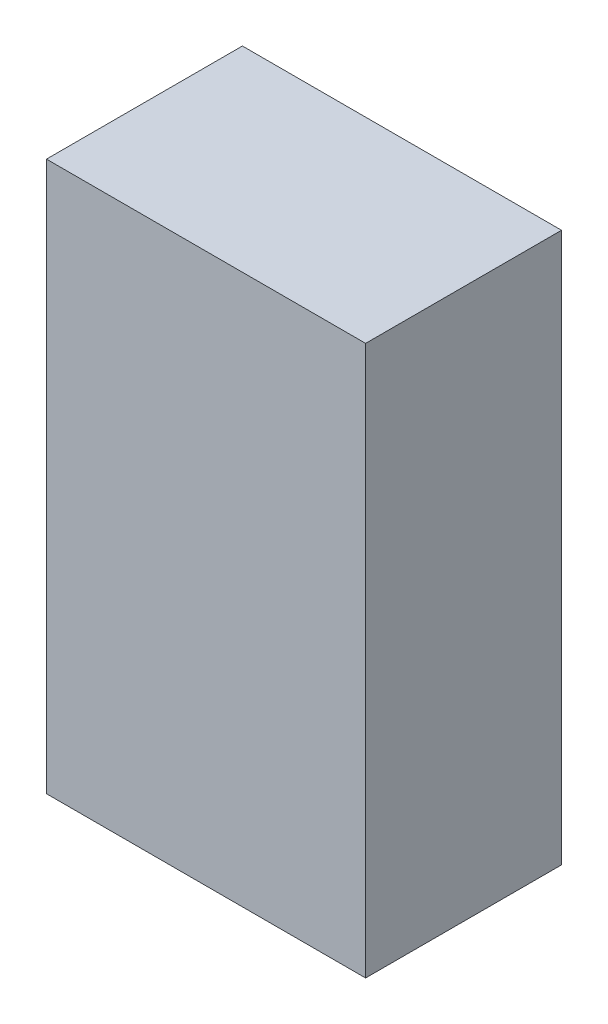
ISO-10303-21;
HEADER;
FILE_DESCRIPTION(('STEP AP214'),'2;1');
FILE_NAME('part.step','',(''),(''),'','','');
FILE_SCHEMA(('AUTOMOTIVE_DESIGN { 1 0 10303 214 1 1 1 1 }'));
ENDSEC;
DATA;
#1=APPLICATION_CONTEXT('core data for automotive mechanical design processes');
#2=APPLICATION_PROTOCOL_DEFINITION('international standard','automotive_design',2000,#1);
#3=PRODUCT_CONTEXT('',#1,'mechanical');
#4=PRODUCT('Part','Part','',(#3));
#5=PRODUCT_RELATED_PRODUCT_CATEGORY('part','',(#4));
#6=PRODUCT_DEFINITION_FORMATION('','',#4);
#7=PRODUCT_DEFINITION_CONTEXT('part definition',#1,'design');
#8=PRODUCT_DEFINITION('design','',#6,#7);
#9=PRODUCT_DEFINITION_SHAPE('','',#8);
#10=(LENGTH_UNIT() NAMED_UNIT(*) SI_UNIT(.MILLI.,.METRE.));
#11=(NAMED_UNIT(*) PLANE_ANGLE_UNIT() SI_UNIT($,.RADIAN.));
#12=(NAMED_UNIT(*) SI_UNIT($,.STERADIAN.) SOLID_ANGLE_UNIT());
#13=UNCERTAINTY_MEASURE_WITH_UNIT(LENGTH_MEASURE(1.E-05),#10,'distance_accuracy_value','');
#14=(GEOMETRIC_REPRESENTATION_CONTEXT(3) GLOBAL_UNCERTAINTY_ASSIGNED_CONTEXT((#13)) GLOBAL_UNIT_ASSIGNED_CONTEXT((#10,
#11,#12)) REPRESENTATION_CONTEXT('',''));
#15=CARTESIAN_POINT('',(0.,0.,0.));
#16=DIRECTION('',(0.,0.,1.));
#17=DIRECTION('',(1.,0.,0.));
#18=AXIS2_PLACEMENT_3D('',#15,#16,#17);
#19=CARTESIAN_POINT('',(-1.79999894,3.09999888,2.21000066));
#20=DIRECTION('',(0.,0.,1.));
#21=DIRECTION('',(1.,0.,0.));
#22=AXIS2_PLACEMENT_3D('',#19,#20,#21);
#23=PLANE('',#22);
#24=DIRECTION('',(0.,1.,0.));
#25=VECTOR('',#24,1.);
#26=CARTESIAN_POINT('',(1.79999894,3.09999888,2.21000066));
#27=LINE('',#26,#25);
#28=CARTESIAN_POINT('',(1.79999894,3.09999888,2.21000066));
#29=VERTEX_POINT('',#28);
#30=CARTESIAN_POINT('',(1.79999894,-3.09999888,2.21000066));
#31=VERTEX_POINT('',#30);
#32=EDGE_CURVE('E53',#29,#31,#27,.F.);
#33=ORIENTED_EDGE('',*,*,#32,.F.);
#34=DIRECTION('',(1.,0.,0.));
#35=VECTOR('',#34,1.);
#36=CARTESIAN_POINT('',(-1.79999894,3.09999888,2.21000066));
#37=LINE('',#36,#35);
#38=CARTESIAN_POINT('',(-1.79999894,3.09999888,2.21000066));
#39=VERTEX_POINT('',#38);
#40=EDGE_CURVE('E68',#39,#29,#37,.T.);
#41=ORIENTED_EDGE('',*,*,#40,.F.);
#42=DIRECTION('',(0.,1.,0.));
#43=VECTOR('',#42,1.);
#44=CARTESIAN_POINT('',(-1.79999894,-3.09999888,2.21000066));
#45=LINE('',#44,#43);
#46=CARTESIAN_POINT('',(-1.79999894,-3.09999888,2.21000066));
#47=VERTEX_POINT('',#46);
#48=EDGE_CURVE('E20',#47,#39,#45,.T.);
#49=ORIENTED_EDGE('',*,*,#48,.F.);
#50=DIRECTION('',(1.,0.,0.));
#51=VECTOR('',#50,1.);
#52=CARTESIAN_POINT('',(1.79999894,-3.09999888,2.21000066));
#53=LINE('',#52,#51);
#54=EDGE_CURVE('E58',#31,#47,#53,.F.);
#55=ORIENTED_EDGE('',*,*,#54,.F.);
#56=EDGE_LOOP('',(#33,#41,#49,#55));
#57=FACE_BOUND('',#56,.T.);
#58=ADVANCED_FACE('F17',(#57),#23,.T.);
#59=CARTESIAN_POINT('',(-1.79999894,-3.09999888,0.));
#60=DIRECTION('',(-1.,0.,0.));
#61=DIRECTION('',(0.,0.,1.));
#62=AXIS2_PLACEMENT_3D('',#59,#60,#61);
#63=PLANE('',#62);
#64=DIRECTION('',(0.,0.,1.));
#65=VECTOR('',#64,1.);
#66=CARTESIAN_POINT('',(-1.79999894,3.09999888,0.));
#67=LINE('',#66,#65);
#68=CARTESIAN_POINT('',(-1.79999894,3.09999888,0.));
#69=VERTEX_POINT('',#68);
#70=EDGE_CURVE('E79',#69,#39,#67,.T.);
#71=ORIENTED_EDGE('',*,*,#70,.F.);
#72=DIRECTION('',(0.,1.,0.));
#73=VECTOR('',#72,1.);
#74=CARTESIAN_POINT('',(-1.79999894,3.09999888,0.));
#75=LINE('',#74,#73);
#76=CARTESIAN_POINT('',(-1.79999894,-3.09999888,0.));
#77=VERTEX_POINT('',#76);
#78=EDGE_CURVE('E74',#69,#77,#75,.F.);
#79=ORIENTED_EDGE('',*,*,#78,.T.);
#80=DIRECTION('',(0.,0.,-1.));
#81=VECTOR('',#80,1.);
#82=CARTESIAN_POINT('',(-1.79999894,-3.09999888,0.));
#83=LINE('',#82,#81);
#84=EDGE_CURVE('E63',#47,#77,#83,.T.);
#85=ORIENTED_EDGE('',*,*,#84,.F.);
#86=ORIENTED_EDGE('',*,*,#48,.T.);
#87=EDGE_LOOP('',(#71,#79,#85,#86));
#88=FACE_BOUND('',#87,.T.);
#89=ADVANCED_FACE('F73',(#88),#63,.T.);
#90=CARTESIAN_POINT('',(1.79999894,-3.09999888,0.));
#91=DIRECTION('',(0.,-1.,0.));
#92=DIRECTION('',(0.,0.,-1.));
#93=AXIS2_PLACEMENT_3D('',#90,#91,#92);
#94=PLANE('',#93);
#95=ORIENTED_EDGE('',*,*,#84,.T.);
#96=DIRECTION('',(1.,0.,0.));
#97=VECTOR('',#96,1.);
#98=CARTESIAN_POINT('',(-1.79999894,-3.09999888,0.));
#99=LINE('',#98,#97);
#100=CARTESIAN_POINT('',(1.79999894,-3.09999888,0.));
#101=VERTEX_POINT('',#100);
#102=EDGE_CURVE('E84',#77,#101,#99,.T.);
#103=ORIENTED_EDGE('',*,*,#102,.T.);
#104=DIRECTION('',(0.,0.,-1.));
#105=VECTOR('',#104,1.);
#106=CARTESIAN_POINT('',(1.79999894,-3.09999888,0.));
#107=LINE('',#106,#105);
#108=EDGE_CURVE('E65',#31,#101,#107,.T.);
#109=ORIENTED_EDGE('',*,*,#108,.F.);
#110=ORIENTED_EDGE('',*,*,#54,.T.);
#111=EDGE_LOOP('',(#95,#103,#109,#110));
#112=FACE_BOUND('',#111,.T.);
#113=ADVANCED_FACE('F60',(#112),#94,.T.);
#114=CARTESIAN_POINT('',(1.79999894,3.09999888,0.));
#115=DIRECTION('',(1.,0.,0.));
#116=DIRECTION('',(0.,0.,-1.));
#117=AXIS2_PLACEMENT_3D('',#114,#115,#116);
#118=PLANE('',#117);
#119=ORIENTED_EDGE('',*,*,#108,.T.);
#120=DIRECTION('',(0.,1.,0.));
#121=VECTOR('',#120,1.);
#122=CARTESIAN_POINT('',(1.79999894,3.09999888,0.));
#123=LINE('',#122,#121);
#124=CARTESIAN_POINT('',(1.79999894,3.09999888,0.));
#125=VERTEX_POINT('',#124);
#126=EDGE_CURVE('E26',#101,#125,#123,.T.);
#127=ORIENTED_EDGE('',*,*,#126,.T.);
#128=DIRECTION('',(0.,0.,1.));
#129=VECTOR('',#128,1.);
#130=CARTESIAN_POINT('',(1.79999894,3.09999888,0.));
#131=LINE('',#130,#129);
#132=EDGE_CURVE('E34',#29,#125,#131,.F.);
#133=ORIENTED_EDGE('',*,*,#132,.F.);
#134=ORIENTED_EDGE('',*,*,#32,.T.);
#135=EDGE_LOOP('',(#119,#127,#133,#134));
#136=FACE_BOUND('',#135,.T.);
#137=ADVANCED_FACE('F88',(#136),#118,.T.);
#138=CARTESIAN_POINT('',(-1.79999894,3.09999888,0.));
#139=DIRECTION('',(0.,1.,0.));
#140=DIRECTION('',(0.,0.,1.));
#141=AXIS2_PLACEMENT_3D('',#138,#139,#140);
#142=PLANE('',#141);
#143=ORIENTED_EDGE('',*,*,#132,.T.);
#144=DIRECTION('',(1.,0.,0.));
#145=VECTOR('',#144,1.);
#146=CARTESIAN_POINT('',(-1.79999894,3.09999888,0.));
#147=LINE('',#146,#145);
#148=EDGE_CURVE('E11',#125,#69,#147,.F.);
#149=ORIENTED_EDGE('',*,*,#148,.T.);
#150=ORIENTED_EDGE('',*,*,#70,.T.);
#151=ORIENTED_EDGE('',*,*,#40,.T.);
#152=EDGE_LOOP('',(#143,#149,#150,#151));
#153=FACE_BOUND('',#152,.T.);
#154=ADVANCED_FACE('F91',(#153),#142,.T.);
#155=CARTESIAN_POINT('',(-1.79999894,3.09999888,0.));
#156=DIRECTION('',(0.,0.,1.));
#157=DIRECTION('',(1.,0.,0.));
#158=AXIS2_PLACEMENT_3D('',#155,#156,#157);
#159=PLANE('',#158);
#160=ORIENTED_EDGE('',*,*,#126,.F.);
#161=ORIENTED_EDGE('',*,*,#102,.F.);
#162=ORIENTED_EDGE('',*,*,#78,.F.);
#163=ORIENTED_EDGE('',*,*,#148,.F.);
#164=EDGE_LOOP('',(#160,#161,#162,#163));
#165=FACE_BOUND('',#164,.T.);
#166=ADVANCED_FACE('F90',(#165),#159,.F.);
#167=CLOSED_SHELL('',(#58,#89,#113,#137,#154,#166));
#168=MANIFOLD_SOLID_BREP('B1',#167);
#169=ADVANCED_BREP_SHAPE_REPRESENTATION('',(#18,#168),#14);
#170=SHAPE_DEFINITION_REPRESENTATION(#9,#169);
ENDSEC;
END-ISO-10303-21;
